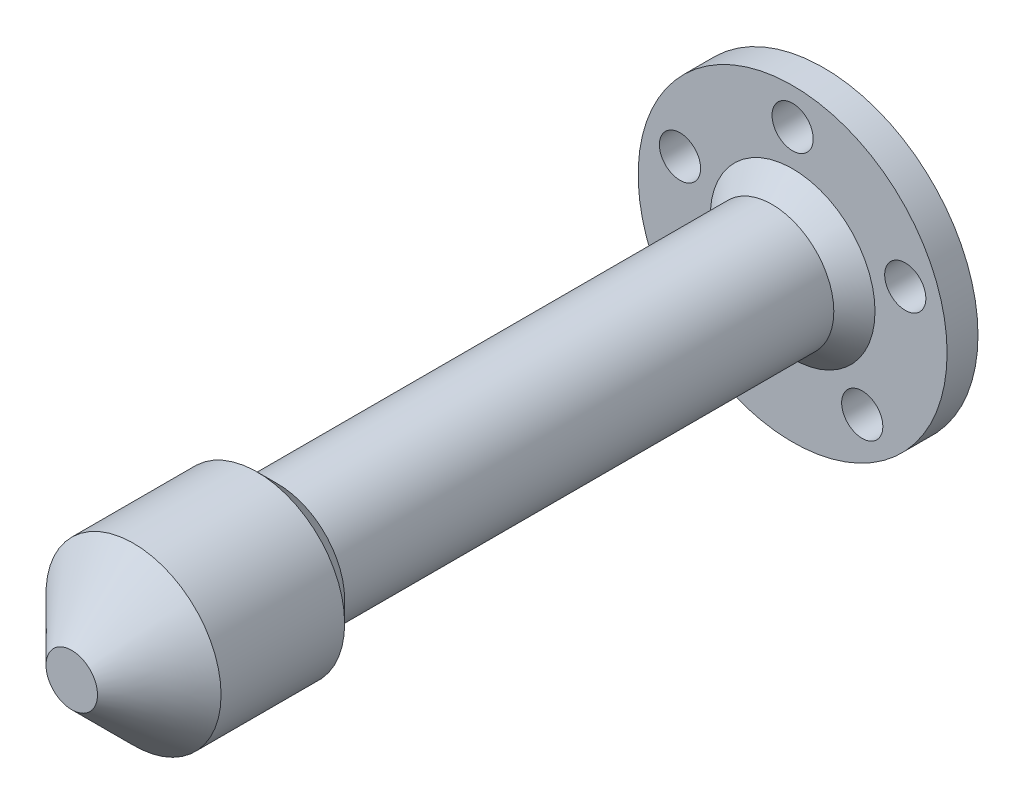
ISO-10303-21;
HEADER;
FILE_DESCRIPTION(('STEP AP214'),'2;1');
FILE_NAME('part.step','',(''),(''),'','','');
FILE_SCHEMA(('AUTOMOTIVE_DESIGN { 1 0 10303 214 1 1 1 1 }'));
ENDSEC;
DATA;
#1=APPLICATION_CONTEXT('core data for automotive mechanical design processes');
#2=APPLICATION_PROTOCOL_DEFINITION('international standard','automotive_design',2000,#1);
#3=PRODUCT_CONTEXT('',#1,'mechanical');
#4=PRODUCT('Part','Part','',(#3));
#5=PRODUCT_RELATED_PRODUCT_CATEGORY('part','',(#4));
#6=PRODUCT_DEFINITION_FORMATION('','',#4);
#7=PRODUCT_DEFINITION_CONTEXT('part definition',#1,'design');
#8=PRODUCT_DEFINITION('design','',#6,#7);
#9=PRODUCT_DEFINITION_SHAPE('','',#8);
#10=(LENGTH_UNIT() NAMED_UNIT(*) SI_UNIT(.MILLI.,.METRE.));
#11=(NAMED_UNIT(*) PLANE_ANGLE_UNIT() SI_UNIT($,.RADIAN.));
#12=(NAMED_UNIT(*) SI_UNIT($,.STERADIAN.) SOLID_ANGLE_UNIT());
#13=UNCERTAINTY_MEASURE_WITH_UNIT(LENGTH_MEASURE(1.E-05),#10,'distance_accuracy_value','');
#14=(GEOMETRIC_REPRESENTATION_CONTEXT(3) GLOBAL_UNCERTAINTY_ASSIGNED_CONTEXT((#13)) GLOBAL_UNIT_ASSIGNED_CONTEXT((#10,
#11,#12)) REPRESENTATION_CONTEXT('',''));
#15=CARTESIAN_POINT('',(0.,0.,0.));
#16=DIRECTION('',(0.,0.,1.));
#17=DIRECTION('',(1.,0.,0.));
#18=AXIS2_PLACEMENT_3D('',#15,#16,#17);
#19=CARTESIAN_POINT('',(0.,0.,3.));
#20=DIRECTION('',(0.,0.,-1.));
#21=DIRECTION('',(-1.,0.,0.));
#22=AXIS2_PLACEMENT_3D('',#19,#20,#21);
#23=CYLINDRICAL_SURFACE('',#22,15.);
#24=CARTESIAN_POINT('',(0.,0.,3.));
#25=DIRECTION('',(0.,0.,1.));
#26=DIRECTION('',(1.,0.,0.));
#27=AXIS2_PLACEMENT_3D('',#24,#25,#26);
#28=CIRCLE('',#27,15.);
#29=CARTESIAN_POINT('',(15.,0.,3.));
#30=VERTEX_POINT('',#29);
#31=EDGE_CURVE('E60',#30,#30,#28,.T.);
#32=ORIENTED_EDGE('',*,*,#31,.F.);
#33=EDGE_LOOP('',(#32));
#34=FACE_BOUND('',#33,.T.);
#35=CARTESIAN_POINT('',(0.,0.,0.));
#36=DIRECTION('',(0.,0.,1.));
#37=DIRECTION('',(1.,0.,0.));
#38=AXIS2_PLACEMENT_3D('',#35,#36,#37);
#39=CIRCLE('',#38,15.);
#40=CARTESIAN_POINT('',(15.,0.,0.));
#41=VERTEX_POINT('',#40);
#42=EDGE_CURVE('E61',#41,#41,#39,.T.);
#43=ORIENTED_EDGE('',*,*,#42,.T.);
#44=EDGE_LOOP('',(#43));
#45=FACE_BOUND('',#44,.T.);
#46=ADVANCED_FACE('F33',(#34,#45),#23,.T.);
#47=CARTESIAN_POINT('',(0.,0.,3.));
#48=DIRECTION('',(0.,0.,1.));
#49=DIRECTION('',(1.,0.,0.));
#50=AXIS2_PLACEMENT_3D('',#47,#48,#49);
#51=PLANE('',#50);
#52=CARTESIAN_POINT('',(0.,0.,3.));
#53=DIRECTION('',(0.,0.,1.));
#54=DIRECTION('',(1.,0.,0.));
#55=AXIS2_PLACEMENT_3D('',#52,#53,#54);
#56=CIRCLE('',#55,7.99999999999997);
#57=CARTESIAN_POINT('',(7.99999999999997,0.,3.));
#58=VERTEX_POINT('',#57);
#59=EDGE_CURVE('E54',#58,#58,#56,.F.);
#60=ORIENTED_EDGE('',*,*,#59,.T.);
#61=EDGE_LOOP('',(#60));
#62=FACE_BOUND('',#61,.T.);
#63=CARTESIAN_POINT('',(0.,11.5,3.));
#64=DIRECTION('',(0.,0.,1.));
#65=DIRECTION('',(1.,0.,0.));
#66=AXIS2_PLACEMENT_3D('',#63,#64,#65);
#67=CIRCLE('',#66,2.);
#68=CARTESIAN_POINT('',(2.,11.5,3.));
#69=VERTEX_POINT('',#68);
#70=EDGE_CURVE('E92',#69,#69,#67,.T.);
#71=ORIENTED_EDGE('',*,*,#70,.F.);
#72=EDGE_LOOP('',(#71));
#73=FACE_BOUND('',#72,.T.);
#74=CARTESIAN_POINT('',(-10.9371499373939,3.55369543531143,3.));
#75=DIRECTION('',(0.,0.,1.));
#76=DIRECTION('',(1.,0.,0.));
#77=AXIS2_PLACEMENT_3D('',#74,#75,#76);
#78=CIRCLE('',#77,2.00000000000058);
#79=CARTESIAN_POINT('',(-8.93714993739334,3.55369543531143,3.));
#80=VERTEX_POINT('',#79);
#81=EDGE_CURVE('E89',#80,#80,#78,.T.);
#82=ORIENTED_EDGE('',*,*,#81,.F.);
#83=EDGE_LOOP('',(#82));
#84=FACE_BOUND('',#83,.T.);
#85=CARTESIAN_POINT('',(-6.75953040136256,-9.30369543531218,3.));
#86=DIRECTION('',(0.,0.,1.));
#87=DIRECTION('',(1.,0.,0.));
#88=AXIS2_PLACEMENT_3D('',#85,#86,#87);
#89=CIRCLE('',#88,2.00000000000102);
#90=CARTESIAN_POINT('',(-4.75953040136154,-9.30369543531218,3.));
#91=VERTEX_POINT('',#90);
#92=EDGE_CURVE('E83',#91,#91,#89,.T.);
#93=ORIENTED_EDGE('',*,*,#92,.F.);
#94=EDGE_LOOP('',(#93));
#95=FACE_BOUND('',#94,.T.);
#96=CARTESIAN_POINT('',(6.75953040136432,-9.30369543531161,3.));
#97=DIRECTION('',(0.,0.,1.));
#98=DIRECTION('',(1.,0.,0.));
#99=AXIS2_PLACEMENT_3D('',#96,#97,#98);
#100=CIRCLE('',#99,2.00000000000082);
#101=CARTESIAN_POINT('',(8.75953040136514,-9.30369543531161,3.));
#102=VERTEX_POINT('',#101);
#103=EDGE_CURVE('E77',#102,#102,#100,.T.);
#104=ORIENTED_EDGE('',*,*,#103,.F.);
#105=EDGE_LOOP('',(#104));
#106=FACE_BOUND('',#105,.T.);
#107=CARTESIAN_POINT('',(10.9371499373946,3.55369543531236,3.));
#108=DIRECTION('',(0.,0.,1.));
#109=DIRECTION('',(1.,0.,0.));
#110=AXIS2_PLACEMENT_3D('',#107,#108,#109);
#111=CIRCLE('',#110,2.00000000000022);
#112=CARTESIAN_POINT('',(12.9371499373948,3.55369543531236,3.));
#113=VERTEX_POINT('',#112);
#114=EDGE_CURVE('E70',#113,#113,#111,.T.);
#115=ORIENTED_EDGE('',*,*,#114,.F.);
#116=EDGE_LOOP('',(#115));
#117=FACE_BOUND('',#116,.T.);
#118=ORIENTED_EDGE('',*,*,#31,.T.);
#119=EDGE_LOOP('',(#118));
#120=FACE_BOUND('',#119,.T.);
#121=ADVANCED_FACE('F118',(#62,#73,#84,#95,#106,#117,#120),#51,.T.);
#122=CARTESIAN_POINT('',(0.,0.,0.));
#123=DIRECTION('',(0.,0.,1.));
#124=DIRECTION('',(1.,0.,0.));
#125=AXIS2_PLACEMENT_3D('',#122,#123,#124);
#126=PLANE('',#125);
#127=CARTESIAN_POINT('',(0.,0.,0.));
#128=DIRECTION('',(0.,0.,-1.));
#129=DIRECTION('',(-1.,0.,0.));
#130=AXIS2_PLACEMENT_3D('',#127,#128,#129);
#131=CIRCLE('',#130,4.1);
#132=CARTESIAN_POINT('',(-4.1,0.,0.));
#133=VERTEX_POINT('',#132);
#134=EDGE_CURVE('E100',#133,#133,#131,.T.);
#135=ORIENTED_EDGE('',*,*,#134,.F.);
#136=EDGE_LOOP('',(#135));
#137=FACE_BOUND('',#136,.T.);
#138=CARTESIAN_POINT('',(0.,11.5,0.));
#139=DIRECTION('',(0.,0.,1.));
#140=DIRECTION('',(1.,0.,0.));
#141=AXIS2_PLACEMENT_3D('',#138,#139,#140);
#142=CIRCLE('',#141,2.);
#143=CARTESIAN_POINT('',(2.,11.5,0.));
#144=VERTEX_POINT('',#143);
#145=EDGE_CURVE('E64',#144,#144,#142,.T.);
#146=ORIENTED_EDGE('',*,*,#145,.T.);
#147=EDGE_LOOP('',(#146));
#148=FACE_BOUND('',#147,.T.);
#149=CARTESIAN_POINT('',(-10.9371499373939,3.55369543531143,0.));
#150=DIRECTION('',(0.,0.,1.));
#151=DIRECTION('',(1.,0.,0.));
#152=AXIS2_PLACEMENT_3D('',#149,#150,#151);
#153=CIRCLE('',#152,2.00000000000058);
#154=CARTESIAN_POINT('',(-8.93714993739334,3.55369543531143,0.));
#155=VERTEX_POINT('',#154);
#156=EDGE_CURVE('E86',#155,#155,#153,.T.);
#157=ORIENTED_EDGE('',*,*,#156,.T.);
#158=EDGE_LOOP('',(#157));
#159=FACE_BOUND('',#158,.T.);
#160=CARTESIAN_POINT('',(-6.75953040136256,-9.30369543531218,0.));
#161=DIRECTION('',(0.,0.,1.));
#162=DIRECTION('',(1.,0.,0.));
#163=AXIS2_PLACEMENT_3D('',#160,#161,#162);
#164=CIRCLE('',#163,2.00000000000102);
#165=CARTESIAN_POINT('',(-4.75953040136154,-9.30369543531218,0.));
#166=VERTEX_POINT('',#165);
#167=EDGE_CURVE('E80',#166,#166,#164,.T.);
#168=ORIENTED_EDGE('',*,*,#167,.T.);
#169=EDGE_LOOP('',(#168));
#170=FACE_BOUND('',#169,.T.);
#171=CARTESIAN_POINT('',(6.75953040136432,-9.30369543531161,0.));
#172=DIRECTION('',(0.,0.,1.));
#173=DIRECTION('',(1.,0.,0.));
#174=AXIS2_PLACEMENT_3D('',#171,#172,#173);
#175=CIRCLE('',#174,2.00000000000082);
#176=CARTESIAN_POINT('',(8.75953040136514,-9.30369543531161,0.));
#177=VERTEX_POINT('',#176);
#178=EDGE_CURVE('E74',#177,#177,#175,.T.);
#179=ORIENTED_EDGE('',*,*,#178,.T.);
#180=EDGE_LOOP('',(#179));
#181=FACE_BOUND('',#180,.T.);
#182=CARTESIAN_POINT('',(10.9371499373946,3.55369543531236,0.));
#183=DIRECTION('',(0.,0.,1.));
#184=DIRECTION('',(1.,0.,0.));
#185=AXIS2_PLACEMENT_3D('',#182,#183,#184);
#186=CIRCLE('',#185,2.00000000000022);
#187=CARTESIAN_POINT('',(12.9371499373948,3.55369543531236,0.));
#188=VERTEX_POINT('',#187);
#189=EDGE_CURVE('E67',#188,#188,#186,.T.);
#190=ORIENTED_EDGE('',*,*,#189,.T.);
#191=EDGE_LOOP('',(#190));
#192=FACE_BOUND('',#191,.T.);
#193=ORIENTED_EDGE('',*,*,#42,.F.);
#194=EDGE_LOOP('',(#193));
#195=FACE_BOUND('',#194,.T.);
#196=ADVANCED_FACE('F114',(#137,#148,#159,#170,#181,#192,#195),#126,.F.);
#197=CARTESIAN_POINT('',(10.9371499373946,3.55369543531236,0.));
#198=DIRECTION('',(0.,0.,1.));
#199=DIRECTION('',(1.,0.,0.));
#200=AXIS2_PLACEMENT_3D('',#197,#198,#199);
#201=CYLINDRICAL_SURFACE('',#200,2.00000000000022);
#202=ORIENTED_EDGE('',*,*,#189,.F.);
#203=EDGE_LOOP('',(#202));
#204=FACE_BOUND('',#203,.T.);
#205=ORIENTED_EDGE('',*,*,#114,.T.);
#206=EDGE_LOOP('',(#205));
#207=FACE_BOUND('',#206,.T.);
#208=ADVANCED_FACE('F117',(#204,#207),#201,.F.);
#209=CARTESIAN_POINT('',(6.75953040136432,-9.30369543531161,0.));
#210=DIRECTION('',(0.,0.,1.));
#211=DIRECTION('',(1.,0.,0.));
#212=AXIS2_PLACEMENT_3D('',#209,#210,#211);
#213=CYLINDRICAL_SURFACE('',#212,2.00000000000082);
#214=ORIENTED_EDGE('',*,*,#178,.F.);
#215=EDGE_LOOP('',(#214));
#216=FACE_BOUND('',#215,.T.);
#217=ORIENTED_EDGE('',*,*,#103,.T.);
#218=EDGE_LOOP('',(#217));
#219=FACE_BOUND('',#218,.T.);
#220=ADVANCED_FACE('F190',(#216,#219),#213,.F.);
#221=CARTESIAN_POINT('',(-6.75953040136256,-9.30369543531218,0.));
#222=DIRECTION('',(0.,0.,1.));
#223=DIRECTION('',(1.,0.,0.));
#224=AXIS2_PLACEMENT_3D('',#221,#222,#223);
#225=CYLINDRICAL_SURFACE('',#224,2.00000000000102);
#226=ORIENTED_EDGE('',*,*,#167,.F.);
#227=EDGE_LOOP('',(#226));
#228=FACE_BOUND('',#227,.T.);
#229=ORIENTED_EDGE('',*,*,#92,.T.);
#230=EDGE_LOOP('',(#229));
#231=FACE_BOUND('',#230,.T.);
#232=ADVANCED_FACE('F186',(#228,#231),#225,.F.);
#233=CARTESIAN_POINT('',(-10.9371499373939,3.55369543531143,0.));
#234=DIRECTION('',(0.,0.,1.));
#235=DIRECTION('',(1.,0.,0.));
#236=AXIS2_PLACEMENT_3D('',#233,#234,#235);
#237=CYLINDRICAL_SURFACE('',#236,2.00000000000058);
#238=ORIENTED_EDGE('',*,*,#156,.F.);
#239=EDGE_LOOP('',(#238));
#240=FACE_BOUND('',#239,.T.);
#241=ORIENTED_EDGE('',*,*,#81,.T.);
#242=EDGE_LOOP('',(#241));
#243=FACE_BOUND('',#242,.T.);
#244=ADVANCED_FACE('F182',(#240,#243),#237,.F.);
#245=CARTESIAN_POINT('',(0.,11.5,0.));
#246=DIRECTION('',(0.,0.,1.));
#247=DIRECTION('',(1.,0.,0.));
#248=AXIS2_PLACEMENT_3D('',#245,#246,#247);
#249=CYLINDRICAL_SURFACE('',#248,2.);
#250=ORIENTED_EDGE('',*,*,#145,.F.);
#251=EDGE_LOOP('',(#250));
#252=FACE_BOUND('',#251,.T.);
#253=ORIENTED_EDGE('',*,*,#70,.T.);
#254=EDGE_LOOP('',(#253));
#255=FACE_BOUND('',#254,.T.);
#256=ADVANCED_FACE('F178',(#252,#255),#249,.F.);
#257=CARTESIAN_POINT('',(0.,0.,53.));
#258=DIRECTION('',(0.,0.,-1.));
#259=DIRECTION('',(-1.,0.,0.));
#260=AXIS2_PLACEMENT_3D('',#257,#258,#259);
#261=CYLINDRICAL_SURFACE('',#260,6.);
#262=CARTESIAN_POINT('',(0.,0.,4.99999999999999));
#263=DIRECTION('',(0.,0.,1.));
#264=DIRECTION('',(1.,0.,0.));
#265=AXIS2_PLACEMENT_3D('',#262,#263,#264);
#266=CIRCLE('',#265,6.);
#267=CARTESIAN_POINT('',(6.,0.,4.99999999999999));
#268=VERTEX_POINT('',#267);
#269=EDGE_CURVE('E57',#268,#268,#266,.T.);
#270=ORIENTED_EDGE('',*,*,#269,.T.);
#271=EDGE_LOOP('',(#270));
#272=FACE_BOUND('',#271,.T.);
#273=CARTESIAN_POINT('',(0.,0.,53.));
#274=DIRECTION('',(0.,0.,1.));
#275=DIRECTION('',(1.,0.,0.));
#276=AXIS2_PLACEMENT_3D('',#273,#274,#275);
#277=CIRCLE('',#276,6.);
#278=CARTESIAN_POINT('',(6.,0.,53.));
#279=VERTEX_POINT('',#278);
#280=EDGE_CURVE('E71',#279,#279,#277,.T.);
#281=ORIENTED_EDGE('',*,*,#280,.F.);
#282=EDGE_LOOP('',(#281));
#283=FACE_BOUND('',#282,.T.);
#284=ADVANCED_FACE('F149',(#272,#283),#261,.T.);
#285=CARTESIAN_POINT('',(0.,0.,4.99999999999999));
#286=DIRECTION('',(0.,0.,-1.));
#287=DIRECTION('',(-1.,0.,0.));
#288=AXIS2_PLACEMENT_3D('',#285,#286,#287);
#289=CONICAL_SURFACE('',#288,6.,0.785398163397444);
#290=ORIENTED_EDGE('',*,*,#59,.F.);
#291=EDGE_LOOP('',(#290));
#292=FACE_BOUND('',#291,.T.);
#293=ORIENTED_EDGE('',*,*,#269,.F.);
#294=EDGE_LOOP('',(#293));
#295=FACE_BOUND('',#294,.T.);
#296=ADVANCED_FACE('F143',(#292,#295),#289,.T.);
#297=CARTESIAN_POINT('',(0.,0.,73.));
#298=DIRECTION('',(0.,0.,-1.));
#299=DIRECTION('',(-1.,0.,0.));
#300=AXIS2_PLACEMENT_3D('',#297,#298,#299);
#301=CYLINDRICAL_SURFACE('',#300,8.5);
#302=CARTESIAN_POINT('',(0.,0.,55.));
#303=DIRECTION('',(0.,0.,1.));
#304=DIRECTION('',(1.,0.,0.));
#305=AXIS2_PLACEMENT_3D('',#302,#303,#304);
#306=CIRCLE('',#305,8.5);
#307=CARTESIAN_POINT('',(8.5,0.,55.));
#308=VERTEX_POINT('',#307);
#309=EDGE_CURVE('E41',#308,#308,#306,.T.);
#310=ORIENTED_EDGE('',*,*,#309,.T.);
#311=EDGE_LOOP('',(#310));
#312=FACE_BOUND('',#311,.T.);
#313=CARTESIAN_POINT('',(0.,0.,67.));
#314=DIRECTION('',(0.,0.,1.));
#315=DIRECTION('',(1.,0.,0.));
#316=AXIS2_PLACEMENT_3D('',#313,#314,#315);
#317=CIRCLE('',#316,8.5);
#318=CARTESIAN_POINT('',(8.5,0.,67.));
#319=VERTEX_POINT('',#318);
#320=EDGE_CURVE('E45',#319,#319,#317,.F.);
#321=ORIENTED_EDGE('',*,*,#320,.T.);
#322=EDGE_LOOP('',(#321));
#323=FACE_BOUND('',#322,.T.);
#324=ADVANCED_FACE('F148',(#312,#323),#301,.T.);
#325=CARTESIAN_POINT('',(0.,0.,73.));
#326=DIRECTION('',(0.,0.,1.));
#327=DIRECTION('',(1.,0.,0.));
#328=AXIS2_PLACEMENT_3D('',#325,#326,#327);
#329=PLANE('',#328);
#330=CARTESIAN_POINT('',(0.,0.,73.));
#331=DIRECTION('',(0.,0.,1.));
#332=DIRECTION('',(1.,0.,0.));
#333=AXIS2_PLACEMENT_3D('',#330,#331,#332);
#334=CIRCLE('',#333,2.49999999999999);
#335=CARTESIAN_POINT('',(2.49999999999999,0.,73.));
#336=VERTEX_POINT('',#335);
#337=EDGE_CURVE('E49',#336,#336,#334,.T.);
#338=ORIENTED_EDGE('',*,*,#337,.T.);
#339=EDGE_LOOP('',(#338));
#340=FACE_BOUND('',#339,.T.);
#341=ADVANCED_FACE('F162',(#340),#329,.T.);
#342=CARTESIAN_POINT('',(0.,0.,53.));
#343=DIRECTION('',(0.,0.,1.));
#344=DIRECTION('',(1.,0.,0.));
#345=AXIS2_PLACEMENT_3D('',#342,#343,#344);
#346=PLANE('',#345);
#347=CARTESIAN_POINT('',(0.,0.,53.));
#348=DIRECTION('',(0.,0.,1.));
#349=DIRECTION('',(1.,0.,0.));
#350=AXIS2_PLACEMENT_3D('',#347,#348,#349);
#351=CIRCLE('',#350,6.49999999999998);
#352=CARTESIAN_POINT('',(6.49999999999998,0.,53.));
#353=VERTEX_POINT('',#352);
#354=EDGE_CURVE('E10',#353,#353,#351,.F.);
#355=ORIENTED_EDGE('',*,*,#354,.T.);
#356=EDGE_LOOP('',(#355));
#357=FACE_BOUND('',#356,.T.);
#358=ORIENTED_EDGE('',*,*,#280,.T.);
#359=EDGE_LOOP('',(#358));
#360=FACE_BOUND('',#359,.T.);
#361=ADVANCED_FACE('F155',(#357,#360),#346,.F.);
#362=CARTESIAN_POINT('',(0.,0.,73.));
#363=DIRECTION('',(0.,0.,-1.));
#364=DIRECTION('',(-1.,0.,0.));
#365=AXIS2_PLACEMENT_3D('',#362,#363,#364);
#366=CONICAL_SURFACE('',#365,2.49999999999999,0.785398163397447);
#367=ORIENTED_EDGE('',*,*,#320,.F.);
#368=EDGE_LOOP('',(#367));
#369=FACE_BOUND('',#368,.T.);
#370=ORIENTED_EDGE('',*,*,#337,.F.);
#371=EDGE_LOOP('',(#370));
#372=FACE_BOUND('',#371,.T.);
#373=ADVANCED_FACE('F151',(#369,#372),#366,.T.);
#374=CARTESIAN_POINT('',(0.,0.,55.));
#375=DIRECTION('',(0.,0.,1.));
#376=DIRECTION('',(1.,0.,0.));
#377=AXIS2_PLACEMENT_3D('',#374,#375,#376);
#378=CONICAL_SURFACE('',#377,8.5,0.78539816339745);
#379=ORIENTED_EDGE('',*,*,#354,.F.);
#380=EDGE_LOOP('',(#379));
#381=FACE_BOUND('',#380,.T.);
#382=ORIENTED_EDGE('',*,*,#309,.F.);
#383=EDGE_LOOP('',(#382));
#384=FACE_BOUND('',#383,.T.);
#385=ADVANCED_FACE('F36',(#381,#384),#378,.T.);
#386=CARTESIAN_POINT('',(0.,0.,60.));
#387=DIRECTION('',(0.,0.,-1.));
#388=DIRECTION('',(-1.,0.,0.));
#389=AXIS2_PLACEMENT_3D('',#386,#387,#388);
#390=CYLINDRICAL_SURFACE('',#389,4.1);
#391=CARTESIAN_POINT('',(0.,0.,60.));
#392=DIRECTION('',(0.,0.,-1.));
#393=DIRECTION('',(-1.,0.,0.));
#394=AXIS2_PLACEMENT_3D('',#391,#392,#393);
#395=CIRCLE('',#394,4.1);
#396=CARTESIAN_POINT('',(-4.1,0.,60.));
#397=VERTEX_POINT('',#396);
#398=EDGE_CURVE('E99',#397,#397,#395,.T.);
#399=ORIENTED_EDGE('',*,*,#398,.F.);
#400=EDGE_LOOP('',(#399));
#401=FACE_BOUND('',#400,.T.);
#402=ORIENTED_EDGE('',*,*,#134,.T.);
#403=EDGE_LOOP('',(#402));
#404=FACE_BOUND('',#403,.T.);
#405=ADVANCED_FACE('F108',(#401,#404),#390,.F.);
#406=CARTESIAN_POINT('',(0.,0.,60.));
#407=DIRECTION('',(0.,0.,-1.));
#408=DIRECTION('',(-1.,0.,0.));
#409=AXIS2_PLACEMENT_3D('',#406,#407,#408);
#410=PLANE('',#409);
#411=ORIENTED_EDGE('',*,*,#398,.T.);
#412=EDGE_LOOP('',(#411));
#413=FACE_BOUND('',#412,.T.);
#414=ADVANCED_FACE('F106',(#413),#410,.T.);
#415=CLOSED_SHELL('',(#46,#121,#196,#208,#220,#232,#244,#256,#284,#296,#324,#341,#361,#373,#385,
#405,#414));
#416=MANIFOLD_SOLID_BREP('B2',#415);
#417=ADVANCED_BREP_SHAPE_REPRESENTATION('',(#18,#416),#14);
#418=SHAPE_DEFINITION_REPRESENTATION(#9,#417);
ENDSEC;
END-ISO-10303-21;
